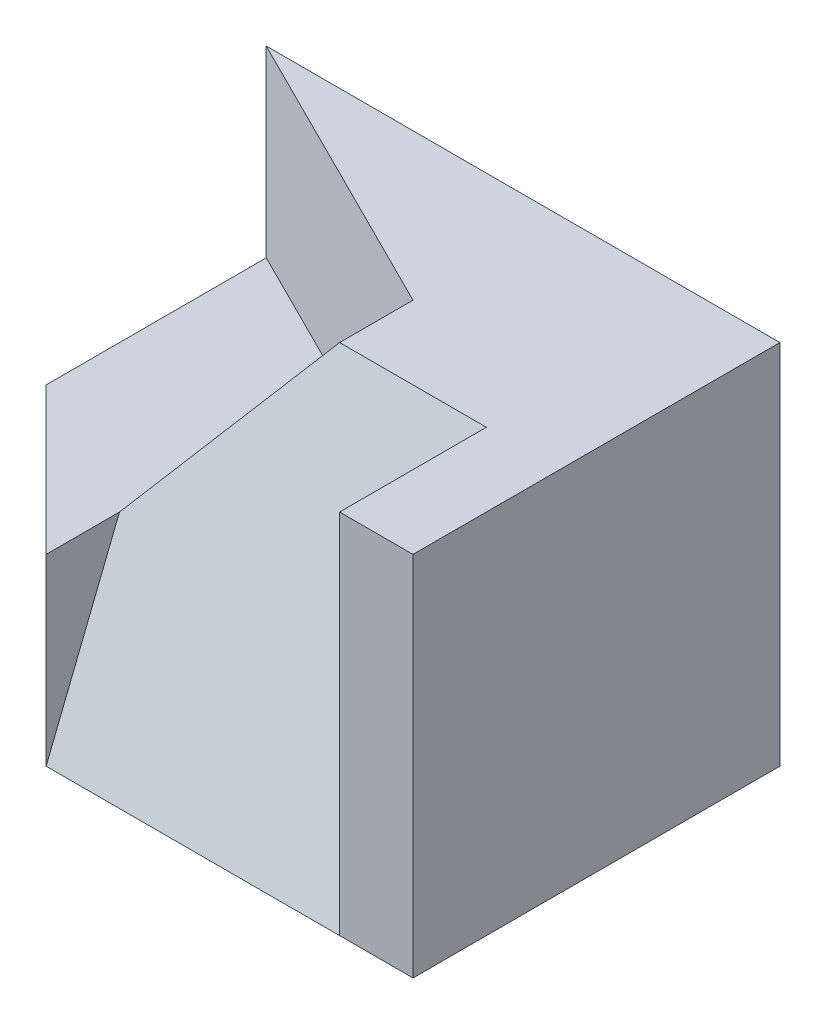
ISO-10303-21;
HEADER;
FILE_DESCRIPTION(('STEP AP214'),'2;1');
FILE_NAME('part.step','',(''),(''),'','','');
FILE_SCHEMA(('AUTOMOTIVE_DESIGN { 1 0 10303 214 1 1 1 1 }'));
ENDSEC;
DATA;
#1=APPLICATION_CONTEXT('core data for automotive mechanical design processes');
#2=APPLICATION_PROTOCOL_DEFINITION('international standard','automotive_design',2000,#1);
#3=PRODUCT_CONTEXT('',#1,'mechanical');
#4=PRODUCT('Part','Part','',(#3));
#5=PRODUCT_RELATED_PRODUCT_CATEGORY('part','',(#4));
#6=PRODUCT_DEFINITION_FORMATION('','',#4);
#7=PRODUCT_DEFINITION_CONTEXT('part definition',#1,'design');
#8=PRODUCT_DEFINITION('design','',#6,#7);
#9=PRODUCT_DEFINITION_SHAPE('','',#8);
#10=(LENGTH_UNIT() NAMED_UNIT(*) SI_UNIT(.MILLI.,.METRE.));
#11=(NAMED_UNIT(*) PLANE_ANGLE_UNIT() SI_UNIT($,.RADIAN.));
#12=(NAMED_UNIT(*) SI_UNIT($,.STERADIAN.) SOLID_ANGLE_UNIT());
#13=UNCERTAINTY_MEASURE_WITH_UNIT(LENGTH_MEASURE(1.E-05),#10,'distance_accuracy_value','');
#14=(GEOMETRIC_REPRESENTATION_CONTEXT(3) GLOBAL_UNCERTAINTY_ASSIGNED_CONTEXT((#13)) GLOBAL_UNIT_ASSIGNED_CONTEXT((#10,
#11,#12)) REPRESENTATION_CONTEXT('',''));
#15=CARTESIAN_POINT('',(0.,0.,0.));
#16=DIRECTION('',(0.,0.,1.));
#17=DIRECTION('',(1.,0.,0.));
#18=AXIS2_PLACEMENT_3D('',#15,#16,#17);
#19=CARTESIAN_POINT('',(0.,17.2413793103448,43.1034482758621));
#20=DIRECTION('',(0.,-0.371390676354104,-0.92847669088526));
#21=DIRECTION('',(0.,0.928476690885259,-0.371390676354104));
#22=AXIS2_PLACEMENT_3D('',#19,#20,#21);
#23=PLANE('',#22);
#24=DIRECTION('',(-0.596284793999944,-0.74535599249993,0.298142396999972));
#25=VECTOR('',#24,1.);
#26=CARTESIAN_POINT('',(20.,25.,40.));
#27=LINE('',#26,#25);
#28=CARTESIAN_POINT('',(40.,50.,30.));
#29=VERTEX_POINT('',#28);
#30=CARTESIAN_POINT('',(20.,25.,40.));
#31=VERTEX_POINT('',#30);
#32=EDGE_CURVE('E150',#29,#31,#27,.T.);
#33=ORIENTED_EDGE('',*,*,#32,.T.);
#34=DIRECTION('',(0.,-0.92847669088526,0.371390676354104));
#35=VECTOR('',#34,1.);
#36=CARTESIAN_POINT('',(20.,0.,50.));
#37=LINE('',#36,#35);
#38=CARTESIAN_POINT('',(20.,0.,50.));
#39=VERTEX_POINT('',#38);
#40=EDGE_CURVE('E39',#31,#39,#37,.T.);
#41=ORIENTED_EDGE('',*,*,#40,.T.);
#42=DIRECTION('',(1.,0.,0.));
#43=VECTOR('',#42,1.);
#44=CARTESIAN_POINT('',(0.,0.,50.));
#45=LINE('',#44,#43);
#46=CARTESIAN_POINT('',(60.,0.,50.));
#47=VERTEX_POINT('',#46);
#48=EDGE_CURVE('E136',#39,#47,#45,.T.);
#49=ORIENTED_EDGE('',*,*,#48,.T.);
#50=DIRECTION('',(0.,0.928476690885259,-0.371390676354104));
#51=VECTOR('',#50,1.);
#52=CARTESIAN_POINT('',(60.,50.,30.));
#53=LINE('',#52,#51);
#54=CARTESIAN_POINT('',(60.,50.,30.));
#55=VERTEX_POINT('',#54);
#56=EDGE_CURVE('E45',#47,#55,#53,.T.);
#57=ORIENTED_EDGE('',*,*,#56,.T.);
#58=DIRECTION('',(-1.,0.,0.));
#59=VECTOR('',#58,1.);
#60=CARTESIAN_POINT('',(60.,50.,30.));
#61=LINE('',#60,#59);
#62=EDGE_CURVE('E11',#55,#29,#61,.T.);
#63=ORIENTED_EDGE('',*,*,#62,.T.);
#64=EDGE_LOOP('',(#33,#41,#49,#57,#63));
#65=FACE_BOUND('',#64,.T.);
#66=ADVANCED_FACE('F35',(#65),#23,.F.);
#67=CARTESIAN_POINT('',(60.,0.,30.));
#68=DIRECTION('',(1.,0.,0.));
#69=DIRECTION('',(0.,1.,0.));
#70=AXIS2_PLACEMENT_3D('',#67,#68,#69);
#71=PLANE('',#70);
#72=DIRECTION('',(0.,0.,1.));
#73=VECTOR('',#72,1.);
#74=CARTESIAN_POINT('',(60.,50.,30.));
#75=LINE('',#74,#73);
#76=CARTESIAN_POINT('',(60.,50.,50.));
#77=VERTEX_POINT('',#76);
#78=EDGE_CURVE('E104',#55,#77,#75,.T.);
#79=ORIENTED_EDGE('',*,*,#78,.F.);
#80=ORIENTED_EDGE('',*,*,#56,.F.);
#81=DIRECTION('',(0.,1.,0.));
#82=VECTOR('',#81,1.);
#83=CARTESIAN_POINT('',(60.,0.,50.));
#84=LINE('',#83,#82);
#85=EDGE_CURVE('E145',#47,#77,#84,.T.);
#86=ORIENTED_EDGE('',*,*,#85,.T.);
#87=EDGE_LOOP('',(#79,#80,#86));
#88=FACE_BOUND('',#87,.T.);
#89=ADVANCED_FACE('F203',(#88),#71,.F.);
#90=CARTESIAN_POINT('',(0.,0.,50.));
#91=DIRECTION('',(0.,0.,-1.));
#92=DIRECTION('',(-1.,0.,0.));
#93=AXIS2_PLACEMENT_3D('',#90,#91,#92);
#94=PLANE('',#93);
#95=ORIENTED_EDGE('',*,*,#85,.F.);
#96=CARTESIAN_POINT('',(70.,0.,50.));
#97=VERTEX_POINT('',#96);
#98=EDGE_CURVE('E138',#47,#97,#45,.T.);
#99=ORIENTED_EDGE('',*,*,#98,.T.);
#100=DIRECTION('',(0.,1.,0.));
#101=VECTOR('',#100,1.);
#102=CARTESIAN_POINT('',(70.,0.,50.));
#103=LINE('',#102,#101);
#104=CARTESIAN_POINT('',(70.,50.,50.));
#105=VERTEX_POINT('',#104);
#106=EDGE_CURVE('E144',#97,#105,#103,.T.);
#107=ORIENTED_EDGE('',*,*,#106,.T.);
#108=DIRECTION('',(-1.,0.,0.));
#109=VECTOR('',#108,1.);
#110=CARTESIAN_POINT('',(0.,50.,50.));
#111=LINE('',#110,#109);
#112=EDGE_CURVE('E103',#105,#77,#111,.T.);
#113=ORIENTED_EDGE('',*,*,#112,.T.);
#114=EDGE_LOOP('',(#95,#99,#107,#113));
#115=FACE_BOUND('',#114,.T.);
#116=ADVANCED_FACE('F37',(#115),#94,.F.);
#117=CARTESIAN_POINT('',(0.,0.,50.));
#118=DIRECTION('',(1.,0.,0.));
#119=DIRECTION('',(0.,0.,-1.));
#120=AXIS2_PLACEMENT_3D('',#117,#118,#119);
#121=PLANE('',#120);
#122=DIRECTION('',(0.,0.,1.));
#123=VECTOR('',#122,1.);
#124=CARTESIAN_POINT('',(0.,25.,0.));
#125=LINE('',#124,#123);
#126=CARTESIAN_POINT('',(0.,25.,0.));
#127=VERTEX_POINT('',#126);
#128=CARTESIAN_POINT('',(0.,25.,30.));
#129=VERTEX_POINT('',#128);
#130=EDGE_CURVE('E130',#127,#129,#125,.T.);
#131=ORIENTED_EDGE('',*,*,#130,.F.);
#132=DIRECTION('',(0.,-1.,0.));
#133=VECTOR('',#132,1.);
#134=CARTESIAN_POINT('',(0.,0.,0.));
#135=LINE('',#134,#133);
#136=CARTESIAN_POINT('',(0.,0.,0.));
#137=VERTEX_POINT('',#136);
#138=EDGE_CURVE('E162',#127,#137,#135,.T.);
#139=ORIENTED_EDGE('',*,*,#138,.T.);
#140=DIRECTION('',(0.,0.,-1.));
#141=VECTOR('',#140,1.);
#142=CARTESIAN_POINT('',(0.,0.,50.));
#143=LINE('',#142,#141);
#144=CARTESIAN_POINT('',(0.,0.,30.));
#145=VERTEX_POINT('',#144);
#146=EDGE_CURVE('E118',#145,#137,#143,.T.);
#147=ORIENTED_EDGE('',*,*,#146,.F.);
#148=DIRECTION('',(0.,-1.,0.));
#149=VECTOR('',#148,1.);
#150=CARTESIAN_POINT('',(0.,50.,30.));
#151=LINE('',#150,#149);
#152=EDGE_CURVE('E161',#129,#145,#151,.T.);
#153=ORIENTED_EDGE('',*,*,#152,.F.);
#154=EDGE_LOOP('',(#131,#139,#147,#153));
#155=FACE_BOUND('',#154,.T.);
#156=ADVANCED_FACE('F177',(#155),#121,.F.);
#157=CARTESIAN_POINT('',(0.,50.,30.));
#158=DIRECTION('',(0.707106781186548,0.,-0.707106781186548));
#159=DIRECTION('',(-0.707106781186548,0.,-0.707106781186548));
#160=AXIS2_PLACEMENT_3D('',#157,#158,#159);
#161=PLANE('',#160);
#162=DIRECTION('',(0.707106781186548,0.,0.707106781186547));
#163=VECTOR('',#162,1.);
#164=CARTESIAN_POINT('',(0.,25.,30.));
#165=LINE('',#164,#163);
#166=CARTESIAN_POINT('',(20.,25.,50.));
#167=VERTEX_POINT('',#166);
#168=EDGE_CURVE('E126',#129,#167,#165,.T.);
#169=ORIENTED_EDGE('',*,*,#168,.F.);
#170=ORIENTED_EDGE('',*,*,#152,.T.);
#171=DIRECTION('',(0.707106781186548,0.,0.707106781186548));
#172=VECTOR('',#171,1.);
#173=CARTESIAN_POINT('',(0.,0.,30.));
#174=LINE('',#173,#172);
#175=EDGE_CURVE('E121',#145,#39,#174,.T.);
#176=ORIENTED_EDGE('',*,*,#175,.T.);
#177=DIRECTION('',(0.,-1.,0.));
#178=VECTOR('',#177,1.);
#179=CARTESIAN_POINT('',(20.,30.,50.));
#180=LINE('',#179,#178);
#181=EDGE_CURVE('E135',#167,#39,#180,.T.);
#182=ORIENTED_EDGE('',*,*,#181,.F.);
#183=EDGE_LOOP('',(#169,#170,#176,#182));
#184=FACE_BOUND('',#183,.T.);
#185=ADVANCED_FACE('F182',(#184),#161,.F.);
#186=CARTESIAN_POINT('',(0.,0.,50.));
#187=DIRECTION('',(0.,1.,0.));
#188=DIRECTION('',(0.,0.,1.));
#189=AXIS2_PLACEMENT_3D('',#186,#187,#188);
#190=PLANE('',#189);
#191=ORIENTED_EDGE('',*,*,#48,.F.);
#192=ORIENTED_EDGE('',*,*,#175,.F.);
#193=ORIENTED_EDGE('',*,*,#146,.T.);
#194=DIRECTION('',(1.,0.,0.));
#195=VECTOR('',#194,1.);
#196=CARTESIAN_POINT('',(0.,0.,0.));
#197=LINE('',#196,#195);
#198=CARTESIAN_POINT('',(70.,0.,0.));
#199=VERTEX_POINT('',#198);
#200=EDGE_CURVE('E95',#137,#199,#197,.T.);
#201=ORIENTED_EDGE('',*,*,#200,.T.);
#202=DIRECTION('',(0.,0.,-1.));
#203=VECTOR('',#202,1.);
#204=CARTESIAN_POINT('',(70.,0.,50.));
#205=LINE('',#204,#203);
#206=EDGE_CURVE('E91',#97,#199,#205,.T.);
#207=ORIENTED_EDGE('',*,*,#206,.F.);
#208=ORIENTED_EDGE('',*,*,#98,.F.);
#209=EDGE_LOOP('',(#191,#192,#193,#201,#207,#208));
#210=FACE_BOUND('',#209,.T.);
#211=ADVANCED_FACE('F180',(#210),#190,.F.);
#212=CARTESIAN_POINT('',(70.,0.,50.));
#213=DIRECTION('',(-1.,0.,0.));
#214=DIRECTION('',(0.,0.,1.));
#215=AXIS2_PLACEMENT_3D('',#212,#213,#214);
#216=PLANE('',#215);
#217=DIRECTION('',(0.,1.,0.));
#218=VECTOR('',#217,1.);
#219=CARTESIAN_POINT('',(70.,0.,0.));
#220=LINE('',#219,#218);
#221=CARTESIAN_POINT('',(70.,50.,0.));
#222=VERTEX_POINT('',#221);
#223=EDGE_CURVE('E84',#199,#222,#220,.T.);
#224=ORIENTED_EDGE('',*,*,#223,.T.);
#225=DIRECTION('',(0.,0.,-1.));
#226=VECTOR('',#225,1.);
#227=CARTESIAN_POINT('',(70.,50.,50.));
#228=LINE('',#227,#226);
#229=EDGE_CURVE('E88',#105,#222,#228,.T.);
#230=ORIENTED_EDGE('',*,*,#229,.F.);
#231=ORIENTED_EDGE('',*,*,#106,.F.);
#232=ORIENTED_EDGE('',*,*,#206,.T.);
#233=EDGE_LOOP('',(#224,#230,#231,#232));
#234=FACE_BOUND('',#233,.T.);
#235=ADVANCED_FACE('F86',(#234),#216,.F.);
#236=CARTESIAN_POINT('',(0.,50.,50.));
#237=DIRECTION('',(0.,-1.,0.));
#238=DIRECTION('',(0.,0.,-1.));
#239=AXIS2_PLACEMENT_3D('',#236,#237,#238);
#240=PLANE('',#239);
#241=DIRECTION('',(-0.894427190999916,0.,-0.447213595499958));
#242=VECTOR('',#241,1.);
#243=CARTESIAN_POINT('',(0.,50.,0.));
#244=LINE('',#243,#242);
#245=CARTESIAN_POINT('',(40.,50.,20.));
#246=VERTEX_POINT('',#245);
#247=CARTESIAN_POINT('',(0.,50.,0.));
#248=VERTEX_POINT('',#247);
#249=EDGE_CURVE('E111',#246,#248,#244,.T.);
#250=ORIENTED_EDGE('',*,*,#249,.F.);
#251=DIRECTION('',(0.,0.,-1.));
#252=VECTOR('',#251,1.);
#253=CARTESIAN_POINT('',(40.,50.,30.));
#254=LINE('',#253,#252);
#255=EDGE_CURVE('E129',#29,#246,#254,.T.);
#256=ORIENTED_EDGE('',*,*,#255,.F.);
#257=ORIENTED_EDGE('',*,*,#62,.F.);
#258=ORIENTED_EDGE('',*,*,#78,.T.);
#259=ORIENTED_EDGE('',*,*,#112,.F.);
#260=ORIENTED_EDGE('',*,*,#229,.T.);
#261=DIRECTION('',(-1.,0.,0.));
#262=VECTOR('',#261,1.);
#263=CARTESIAN_POINT('',(0.,50.,0.));
#264=LINE('',#263,#262);
#265=EDGE_CURVE('E101',#222,#248,#264,.T.);
#266=ORIENTED_EDGE('',*,*,#265,.T.);
#267=EDGE_LOOP('',(#250,#256,#257,#258,#259,#260,#266));
#268=FACE_BOUND('',#267,.T.);
#269=ADVANCED_FACE('F100',(#268),#240,.F.);
#270=CARTESIAN_POINT('',(0.,0.,0.));
#271=DIRECTION('',(0.,0.,-1.));
#272=DIRECTION('',(-1.,0.,0.));
#273=AXIS2_PLACEMENT_3D('',#270,#271,#272);
#274=PLANE('',#273);
#275=EDGE_CURVE('E110',#248,#127,#135,.T.);
#276=ORIENTED_EDGE('',*,*,#275,.F.);
#277=ORIENTED_EDGE('',*,*,#265,.F.);
#278=ORIENTED_EDGE('',*,*,#223,.F.);
#279=ORIENTED_EDGE('',*,*,#200,.F.);
#280=ORIENTED_EDGE('',*,*,#138,.F.);
#281=EDGE_LOOP('',(#276,#277,#278,#279,#280));
#282=FACE_BOUND('',#281,.T.);
#283=ADVANCED_FACE('F107',(#282),#274,.T.);
#284=CARTESIAN_POINT('',(0.,30.,0.));
#285=DIRECTION('',(0.447213595499958,0.,-0.894427190999916));
#286=DIRECTION('',(-0.894427190999916,0.,-0.447213595499958));
#287=AXIS2_PLACEMENT_3D('',#284,#285,#286);
#288=PLANE('',#287);
#289=DIRECTION('',(-0.894427190999916,0.,-0.447213595499958));
#290=VECTOR('',#289,1.);
#291=CARTESIAN_POINT('',(40.,25.,20.));
#292=LINE('',#291,#290);
#293=CARTESIAN_POINT('',(20.,25.,10.));
#294=VERTEX_POINT('',#293);
#295=EDGE_CURVE('E125',#294,#127,#292,.T.);
#296=ORIENTED_EDGE('',*,*,#295,.F.);
#297=DIRECTION('',(0.596284793999944,0.74535599249993,0.298142396999972));
#298=VECTOR('',#297,1.);
#299=CARTESIAN_POINT('',(40.,50.,20.));
#300=LINE('',#299,#298);
#301=EDGE_CURVE('E154',#294,#246,#300,.T.);
#302=ORIENTED_EDGE('',*,*,#301,.T.);
#303=ORIENTED_EDGE('',*,*,#249,.T.);
#304=ORIENTED_EDGE('',*,*,#275,.T.);
#305=EDGE_LOOP('',(#296,#302,#303,#304));
#306=FACE_BOUND('',#305,.T.);
#307=ADVANCED_FACE('F174',(#306),#288,.F.);
#308=CARTESIAN_POINT('',(0.,25.,0.));
#309=DIRECTION('',(0.,1.,0.));
#310=DIRECTION('',(0.,0.,1.));
#311=AXIS2_PLACEMENT_3D('',#308,#309,#310);
#312=PLANE('',#311);
#313=DIRECTION('',(0.,0.,-1.));
#314=VECTOR('',#313,1.);
#315=CARTESIAN_POINT('',(20.,25.,50.));
#316=LINE('',#315,#314);
#317=EDGE_CURVE('E122',#31,#294,#316,.T.);
#318=ORIENTED_EDGE('',*,*,#317,.T.);
#319=ORIENTED_EDGE('',*,*,#295,.T.);
#320=ORIENTED_EDGE('',*,*,#130,.T.);
#321=ORIENTED_EDGE('',*,*,#168,.T.);
#322=DIRECTION('',(0.,0.,-1.));
#323=VECTOR('',#322,1.);
#324=CARTESIAN_POINT('',(20.,25.,40.));
#325=LINE('',#324,#323);
#326=EDGE_CURVE('E366',#167,#31,#325,.T.);
#327=ORIENTED_EDGE('',*,*,#326,.T.);
#328=EDGE_LOOP('',(#318,#319,#320,#321,#327));
#329=FACE_BOUND('',#328,.T.);
#330=ADVANCED_FACE('F212',(#329),#312,.T.);
#331=CARTESIAN_POINT('',(20.,5.57086014531155,63.9271503632789));
#332=DIRECTION('',(1.,0.,0.));
#333=DIRECTION('',(0.,0.,-1.));
#334=AXIS2_PLACEMENT_3D('',#331,#332,#333);
#335=PLANE('',#334);
#336=ORIENTED_EDGE('',*,*,#181,.T.);
#337=ORIENTED_EDGE('',*,*,#40,.F.);
#338=ORIENTED_EDGE('',*,*,#326,.F.);
#339=EDGE_LOOP('',(#336,#337,#338));
#340=FACE_BOUND('',#339,.T.);
#341=ADVANCED_FACE('F209',(#340),#335,.T.);
#342=CARTESIAN_POINT('',(0.,0.,0.));
#343=DIRECTION('',(-0.78086880944303,0.624695047554424,0.));
#344=DIRECTION('',(-0.624695047554424,-0.78086880944303,0.));
#345=AXIS2_PLACEMENT_3D('',#342,#343,#344);
#346=PLANE('',#345);
#347=ORIENTED_EDGE('',*,*,#32,.F.);
#348=ORIENTED_EDGE('',*,*,#255,.T.);
#349=ORIENTED_EDGE('',*,*,#301,.F.);
#350=ORIENTED_EDGE('',*,*,#317,.F.);
#351=EDGE_LOOP('',(#347,#348,#349,#350));
#352=FACE_BOUND('',#351,.T.);
#353=ADVANCED_FACE('F199',(#352),#346,.T.);
#354=CLOSED_SHELL('',(#66,#89,#116,#156,#185,#211,#235,#269,#283,#307,#330,#341,#353));
#355=MANIFOLD_SOLID_BREP('B2',#354);
#356=ADVANCED_BREP_SHAPE_REPRESENTATION('',(#18,#355),#14);
#357=SHAPE_DEFINITION_REPRESENTATION(#9,#356);
ENDSEC;
END-ISO-10303-21;
